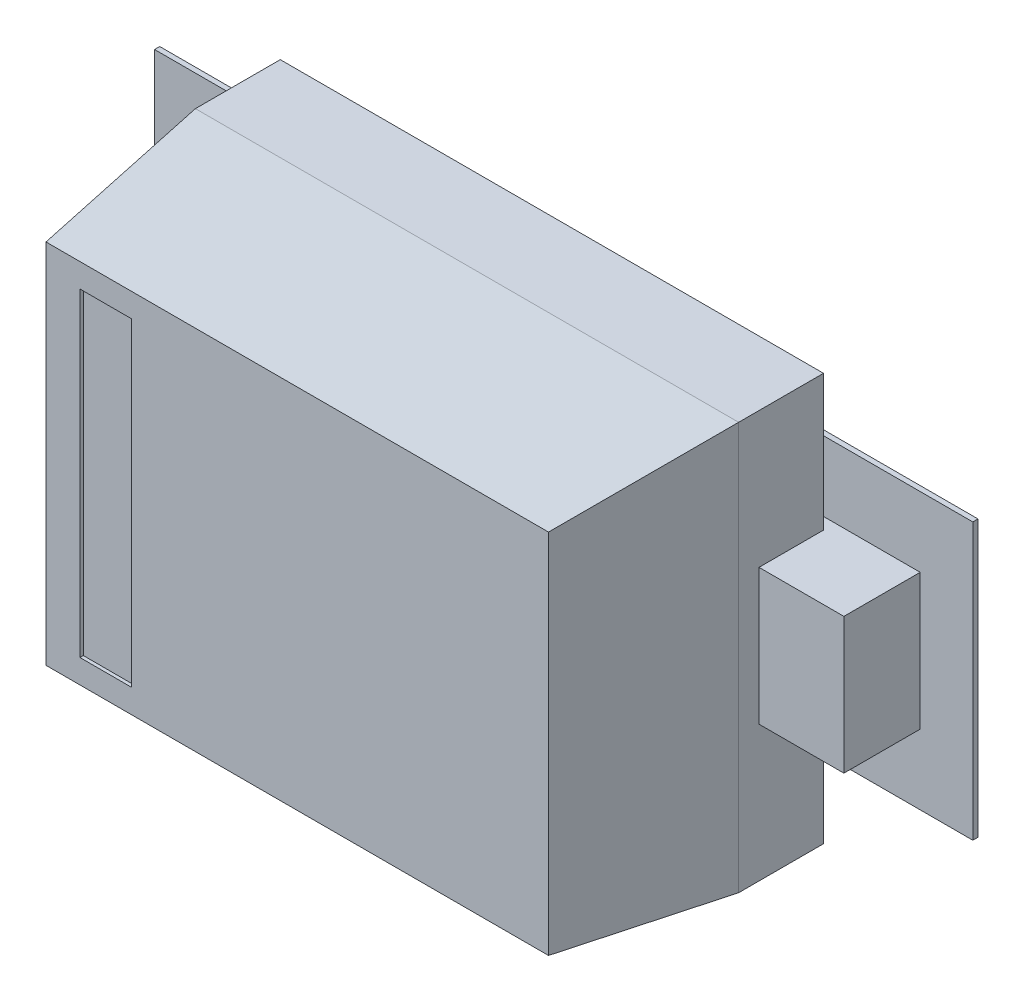
ISO-10303-21;
HEADER;
FILE_DESCRIPTION(('STEP AP214'),'2;1');
FILE_NAME('part.step','',(''),(''),'','','');
FILE_SCHEMA(('AUTOMOTIVE_DESIGN { 1 0 10303 214 1 1 1 1 }'));
ENDSEC;
DATA;
#1=APPLICATION_CONTEXT('core data for automotive mechanical design processes');
#2=APPLICATION_PROTOCOL_DEFINITION('international standard','automotive_design',2000,#1);
#3=PRODUCT_CONTEXT('',#1,'mechanical');
#4=PRODUCT('Part','Part','',(#3));
#5=PRODUCT_RELATED_PRODUCT_CATEGORY('part','',(#4));
#6=PRODUCT_DEFINITION_FORMATION('','',#4);
#7=PRODUCT_DEFINITION_CONTEXT('part definition',#1,'design');
#8=PRODUCT_DEFINITION('design','',#6,#7);
#9=PRODUCT_DEFINITION_SHAPE('','',#8);
#10=(LENGTH_UNIT() NAMED_UNIT(*) SI_UNIT(.MILLI.,.METRE.));
#11=(NAMED_UNIT(*) PLANE_ANGLE_UNIT() SI_UNIT($,.RADIAN.));
#12=(NAMED_UNIT(*) SI_UNIT($,.STERADIAN.) SOLID_ANGLE_UNIT());
#13=UNCERTAINTY_MEASURE_WITH_UNIT(LENGTH_MEASURE(1.E-05),#10,'distance_accuracy_value','');
#14=(GEOMETRIC_REPRESENTATION_CONTEXT(3) GLOBAL_UNCERTAINTY_ASSIGNED_CONTEXT((#13)) GLOBAL_UNIT_ASSIGNED_CONTEXT((#10,
#11,#12)) REPRESENTATION_CONTEXT('',''));
#15=CARTESIAN_POINT('',(0.,0.,0.));
#16=DIRECTION('',(0.,0.,1.));
#17=DIRECTION('',(1.,0.,0.));
#18=AXIS2_PLACEMENT_3D('',#15,#16,#17);
#19=CARTESIAN_POINT('',(-0.525,-0.1,0.0762));
#20=DIRECTION('',(-1.,0.,0.));
#21=DIRECTION('',(0.,0.,1.));
#22=AXIS2_PLACEMENT_3D('',#19,#20,#21);
#23=PLANE('',#22);
#24=DIRECTION('',(0.,1.,0.));
#25=VECTOR('',#24,1.);
#26=CARTESIAN_POINT('',(-0.525,-0.1,0.08382));
#27=LINE('',#26,#25);
#28=CARTESIAN_POINT('',(-0.525,-0.1,0.08382));
#29=VERTEX_POINT('',#28);
#30=CARTESIAN_POINT('',(-0.525,0.1,0.08382));
#31=VERTEX_POINT('',#30);
#32=EDGE_CURVE('E427',#29,#31,#27,.T.);
#33=ORIENTED_EDGE('',*,*,#32,.F.);
#34=DIRECTION('',(0.,0.,1.));
#35=VECTOR('',#34,1.);
#36=CARTESIAN_POINT('',(-0.525,-0.1,0.08382));
#37=LINE('',#36,#35);
#38=CARTESIAN_POINT('',(-0.525,-0.1,0.1962));
#39=VERTEX_POINT('',#38);
#40=EDGE_CURVE('E239',#29,#39,#37,.T.);
#41=ORIENTED_EDGE('',*,*,#40,.T.);
#42=DIRECTION('',(0.,1.,0.));
#43=VECTOR('',#42,1.);
#44=CARTESIAN_POINT('',(-0.525,-0.1,0.1962));
#45=LINE('',#44,#43);
#46=CARTESIAN_POINT('',(-0.525,0.1,0.1962));
#47=VERTEX_POINT('',#46);
#48=EDGE_CURVE('E11',#39,#47,#45,.T.);
#49=ORIENTED_EDGE('',*,*,#48,.T.);
#50=DIRECTION('',(0.,0.,1.));
#51=VECTOR('',#50,1.);
#52=CARTESIAN_POINT('',(-0.525,0.1,0.08382));
#53=LINE('',#52,#51);
#54=EDGE_CURVE('E20',#31,#47,#53,.T.);
#55=ORIENTED_EDGE('',*,*,#54,.F.);
#56=EDGE_LOOP('',(#33,#41,#49,#55));
#57=FACE_BOUND('',#56,.T.);
#58=ADVANCED_FACE('F16',(#57),#23,.T.);
#59=CARTESIAN_POINT('',(-0.525,-0.1,0.1962));
#60=DIRECTION('',(0.,0.,1.));
#61=DIRECTION('',(1.,0.,0.));
#62=AXIS2_PLACEMENT_3D('',#59,#60,#61);
#63=PLANE('',#62);
#64=DIRECTION('',(1.,0.,0.));
#65=VECTOR('',#64,1.);
#66=CARTESIAN_POINT('',(-0.525,-0.1,0.1962));
#67=LINE('',#66,#65);
#68=CARTESIAN_POINT('',(-0.4,-0.1,0.1962));
#69=VERTEX_POINT('',#68);
#70=EDGE_CURVE('E230',#39,#69,#67,.T.);
#71=ORIENTED_EDGE('',*,*,#70,.T.);
#72=DIRECTION('',(0.,1.,0.));
#73=VECTOR('',#72,1.);
#74=CARTESIAN_POINT('',(-0.4,-0.1,0.1962));
#75=LINE('',#74,#73);
#76=CARTESIAN_POINT('',(-0.4,0.1,0.1962));
#77=VERTEX_POINT('',#76);
#78=EDGE_CURVE('E234',#69,#77,#75,.T.);
#79=ORIENTED_EDGE('',*,*,#78,.T.);
#80=DIRECTION('',(1.,0.,0.));
#81=VECTOR('',#80,1.);
#82=CARTESIAN_POINT('',(-0.525,0.1,0.1962));
#83=LINE('',#82,#81);
#84=EDGE_CURVE('E539',#47,#77,#83,.T.);
#85=ORIENTED_EDGE('',*,*,#84,.F.);
#86=ORIENTED_EDGE('',*,*,#48,.F.);
#87=EDGE_LOOP('',(#71,#79,#85,#86));
#88=FACE_BOUND('',#87,.T.);
#89=ADVANCED_FACE('F232',(#88),#63,.T.);
#90=CARTESIAN_POINT('',(-0.325,-0.1,0.1962));
#91=DIRECTION('',(1.,0.,0.));
#92=DIRECTION('',(0.,1.,0.));
#93=AXIS2_PLACEMENT_3D('',#90,#91,#92);
#94=PLANE('',#93);
#95=DIRECTION('',(0.,1.,0.));
#96=VECTOR('',#95,1.);
#97=CARTESIAN_POINT('',(-0.325,-0.1,0.08382));
#98=LINE('',#97,#96);
#99=CARTESIAN_POINT('',(-0.325,-0.1,0.08382));
#100=VERTEX_POINT('',#99);
#101=CARTESIAN_POINT('',(-0.325,0.1,0.08382));
#102=VERTEX_POINT('',#101);
#103=EDGE_CURVE('E440',#100,#102,#98,.T.);
#104=ORIENTED_EDGE('',*,*,#103,.T.);
#105=DIRECTION('',(0.,0.,-1.));
#106=VECTOR('',#105,1.);
#107=CARTESIAN_POINT('',(-0.325,0.1,0.1012));
#108=LINE('',#107,#106);
#109=CARTESIAN_POINT('',(-0.325,0.1,0.1012));
#110=VERTEX_POINT('',#109);
#111=EDGE_CURVE('E27',#110,#102,#108,.T.);
#112=ORIENTED_EDGE('',*,*,#111,.F.);
#113=DIRECTION('',(0.,1.,0.));
#114=VECTOR('',#113,1.);
#115=CARTESIAN_POINT('',(-0.325,-0.1,0.1012));
#116=LINE('',#115,#114);
#117=CARTESIAN_POINT('',(-0.325,-0.1,0.1012));
#118=VERTEX_POINT('',#117);
#119=EDGE_CURVE('E465',#118,#110,#116,.T.);
#120=ORIENTED_EDGE('',*,*,#119,.F.);
#121=DIRECTION('',(0.,0.,-1.));
#122=VECTOR('',#121,1.);
#123=CARTESIAN_POINT('',(-0.325,-0.1,0.1012));
#124=LINE('',#123,#122);
#125=EDGE_CURVE('E240',#118,#100,#124,.T.);
#126=ORIENTED_EDGE('',*,*,#125,.T.);
#127=EDGE_LOOP('',(#104,#112,#120,#126));
#128=FACE_BOUND('',#127,.T.);
#129=ADVANCED_FACE('F656',(#128),#94,.T.);
#130=CARTESIAN_POINT('',(0.325,-0.1,0.0762));
#131=DIRECTION('',(-1.,0.,0.));
#132=DIRECTION('',(0.,0.,1.));
#133=AXIS2_PLACEMENT_3D('',#130,#131,#132);
#134=PLANE('',#133);
#135=DIRECTION('',(0.,1.,0.));
#136=VECTOR('',#135,1.);
#137=CARTESIAN_POINT('',(0.325,-0.1,0.08382));
#138=LINE('',#137,#136);
#139=CARTESIAN_POINT('',(0.325,-0.1,0.08382));
#140=VERTEX_POINT('',#139);
#141=CARTESIAN_POINT('',(0.325,0.1,0.08382));
#142=VERTEX_POINT('',#141);
#143=EDGE_CURVE('E321',#140,#142,#138,.T.);
#144=ORIENTED_EDGE('',*,*,#143,.F.);
#145=DIRECTION('',(0.,0.,1.));
#146=VECTOR('',#145,1.);
#147=CARTESIAN_POINT('',(0.325,-0.1,0.08382));
#148=LINE('',#147,#146);
#149=CARTESIAN_POINT('',(0.325,-0.1,0.1012));
#150=VERTEX_POINT('',#149);
#151=EDGE_CURVE('E274',#140,#150,#148,.T.);
#152=ORIENTED_EDGE('',*,*,#151,.T.);
#153=DIRECTION('',(0.,1.,0.));
#154=VECTOR('',#153,1.);
#155=CARTESIAN_POINT('',(0.325,-0.1,0.1012));
#156=LINE('',#155,#154);
#157=CARTESIAN_POINT('',(0.325,0.1,0.1012));
#158=VERTEX_POINT('',#157);
#159=EDGE_CURVE('E384',#150,#158,#156,.T.);
#160=ORIENTED_EDGE('',*,*,#159,.T.);
#161=DIRECTION('',(0.,0.,1.));
#162=VECTOR('',#161,1.);
#163=CARTESIAN_POINT('',(0.325,0.1,0.08382));
#164=LINE('',#163,#162);
#165=EDGE_CURVE('E444',#142,#158,#164,.T.);
#166=ORIENTED_EDGE('',*,*,#165,.F.);
#167=EDGE_LOOP('',(#144,#152,#160,#166));
#168=FACE_BOUND('',#167,.T.);
#169=ADVANCED_FACE('F875',(#168),#134,.T.);
#170=CARTESIAN_POINT('',(0.,0.1,0.));
#171=DIRECTION('',(0.,1.,0.));
#172=DIRECTION('',(1.,0.,0.));
#173=AXIS2_PLACEMENT_3D('',#170,#171,#172);
#174=PLANE('',#173);
#175=DIRECTION('',(-1.,0.,0.));
#176=VECTOR('',#175,1.);
#177=CARTESIAN_POINT('',(-0.325,0.1,0.08382));
#178=LINE('',#177,#176);
#179=EDGE_CURVE('E436',#102,#31,#178,.T.);
#180=ORIENTED_EDGE('',*,*,#179,.T.);
#181=ORIENTED_EDGE('',*,*,#54,.T.);
#182=ORIENTED_EDGE('',*,*,#84,.T.);
#183=DIRECTION('',(0.,0.,1.));
#184=VECTOR('',#183,1.);
#185=CARTESIAN_POINT('',(-0.4,0.1,0.1012));
#186=LINE('',#185,#184);
#187=CARTESIAN_POINT('',(-0.4,0.1,0.1012));
#188=VERTEX_POINT('',#187);
#189=EDGE_CURVE('E258',#188,#77,#186,.T.);
#190=ORIENTED_EDGE('',*,*,#189,.F.);
#191=DIRECTION('',(1.,0.,0.));
#192=VECTOR('',#191,1.);
#193=CARTESIAN_POINT('',(-0.4,0.1,0.1012));
#194=LINE('',#193,#192);
#195=EDGE_CURVE('E459',#188,#110,#194,.T.);
#196=ORIENTED_EDGE('',*,*,#195,.T.);
#197=ORIENTED_EDGE('',*,*,#111,.T.);
#198=EDGE_LOOP('',(#180,#181,#182,#190,#196,#197));
#199=FACE_BOUND('',#198,.T.);
#200=ADVANCED_FACE('F677',(#199),#174,.T.);
#201=CARTESIAN_POINT('',(0.,0.1,0.));
#202=DIRECTION('',(0.,1.,0.));
#203=DIRECTION('',(1.,0.,0.));
#204=AXIS2_PLACEMENT_3D('',#201,#202,#203);
#205=PLANE('',#204);
#206=DIRECTION('',(-1.,0.,0.));
#207=VECTOR('',#206,1.);
#208=CARTESIAN_POINT('',(0.525,0.1,0.08382));
#209=LINE('',#208,#207);
#210=CARTESIAN_POINT('',(0.525,0.1,0.08382));
#211=VERTEX_POINT('',#210);
#212=EDGE_CURVE('E325',#211,#142,#209,.T.);
#213=ORIENTED_EDGE('',*,*,#212,.T.);
#214=ORIENTED_EDGE('',*,*,#165,.T.);
#215=DIRECTION('',(1.,0.,0.));
#216=VECTOR('',#215,1.);
#217=CARTESIAN_POINT('',(0.325,0.1,0.1012));
#218=LINE('',#217,#216);
#219=CARTESIAN_POINT('',(0.4,0.1,0.1012));
#220=VERTEX_POINT('',#219);
#221=EDGE_CURVE('E388',#158,#220,#218,.T.);
#222=ORIENTED_EDGE('',*,*,#221,.T.);
#223=DIRECTION('',(0.,0.,-1.));
#224=VECTOR('',#223,1.);
#225=CARTESIAN_POINT('',(0.4,0.1,0.1962));
#226=LINE('',#225,#224);
#227=CARTESIAN_POINT('',(0.4,0.1,0.1962));
#228=VERTEX_POINT('',#227);
#229=EDGE_CURVE('E337',#228,#220,#226,.T.);
#230=ORIENTED_EDGE('',*,*,#229,.F.);
#231=DIRECTION('',(1.,0.,0.));
#232=VECTOR('',#231,1.);
#233=CARTESIAN_POINT('',(0.4,0.1,0.1962));
#234=LINE('',#233,#232);
#235=CARTESIAN_POINT('',(0.525,0.1,0.1962));
#236=VERTEX_POINT('',#235);
#237=EDGE_CURVE('E331',#228,#236,#234,.T.);
#238=ORIENTED_EDGE('',*,*,#237,.T.);
#239=DIRECTION('',(0.,0.,-1.));
#240=VECTOR('',#239,1.);
#241=CARTESIAN_POINT('',(0.525,0.1,0.1962));
#242=LINE('',#241,#240);
#243=EDGE_CURVE('E332',#236,#211,#242,.T.);
#244=ORIENTED_EDGE('',*,*,#243,.T.);
#245=EDGE_LOOP('',(#213,#214,#222,#230,#238,#244));
#246=FACE_BOUND('',#245,.T.);
#247=ADVANCED_FACE('F18',(#246),#205,.T.);
#248=CARTESIAN_POINT('',(0.,0.3,0.));
#249=DIRECTION('',(0.,1.,0.));
#250=DIRECTION('',(1.,0.,0.));
#251=AXIS2_PLACEMENT_3D('',#248,#249,#250);
#252=PLANE('',#251);
#253=DIRECTION('',(1.,0.,0.));
#254=VECTOR('',#253,1.);
#255=CARTESIAN_POINT('',(-0.4,0.3,0.2262));
#256=LINE('',#255,#254);
#257=CARTESIAN_POINT('',(-0.4,0.3,0.2262));
#258=VERTEX_POINT('',#257);
#259=CARTESIAN_POINT('',(0.4,0.3,0.2262));
#260=VERTEX_POINT('',#259);
#261=EDGE_CURVE('E441',#258,#260,#256,.T.);
#262=ORIENTED_EDGE('',*,*,#261,.T.);
#263=DIRECTION('',(0.,0.,-1.));
#264=VECTOR('',#263,1.);
#265=CARTESIAN_POINT('',(0.4,0.3,0.2262));
#266=LINE('',#265,#264);
#267=CARTESIAN_POINT('',(0.4,0.3,0.1012));
#268=VERTEX_POINT('',#267);
#269=EDGE_CURVE('E333',#260,#268,#266,.T.);
#270=ORIENTED_EDGE('',*,*,#269,.T.);
#271=DIRECTION('',(-1.,0.,0.));
#272=VECTOR('',#271,1.);
#273=CARTESIAN_POINT('',(0.4,0.3,0.1012));
#274=LINE('',#273,#272);
#275=CARTESIAN_POINT('',(-0.4,0.3,0.1012));
#276=VERTEX_POINT('',#275);
#277=EDGE_CURVE('E455',#268,#276,#274,.T.);
#278=ORIENTED_EDGE('',*,*,#277,.T.);
#279=DIRECTION('',(0.,0.,1.));
#280=VECTOR('',#279,1.);
#281=CARTESIAN_POINT('',(-0.4,0.3,0.1012));
#282=LINE('',#281,#280);
#283=EDGE_CURVE('E380',#276,#258,#282,.T.);
#284=ORIENTED_EDGE('',*,*,#283,.T.);
#285=EDGE_LOOP('',(#262,#270,#278,#284));
#286=FACE_BOUND('',#285,.T.);
#287=ADVANCED_FACE('F673',(#286),#252,.T.);
#288=CARTESIAN_POINT('',(0.,0.285,0.3512));
#289=DIRECTION('',(0.,0.992876838486925,0.119145220618403));
#290=DIRECTION('',(1.,0.,0.));
#291=AXIS2_PLACEMENT_3D('',#288,#289,#290);
#292=PLANE('',#291);
#293=ORIENTED_EDGE('',*,*,#261,.F.);
#294=DIRECTION('',(-0.118308451008796,0.118308451008796,-0.985903758406366));
#295=VECTOR('',#294,1.);
#296=CARTESIAN_POINT('',(-0.37,0.27,0.4762));
#297=LINE('',#296,#295);
#298=CARTESIAN_POINT('',(-0.37,0.27,0.4762));
#299=VERTEX_POINT('',#298);
#300=EDGE_CURVE('E356',#299,#258,#297,.T.);
#301=ORIENTED_EDGE('',*,*,#300,.F.);
#302=DIRECTION('',(1.,0.,0.));
#303=VECTOR('',#302,1.);
#304=CARTESIAN_POINT('',(-0.37,0.27,0.4762));
#305=LINE('',#304,#303);
#306=CARTESIAN_POINT('',(0.37,0.27,0.4762));
#307=VERTEX_POINT('',#306);
#308=EDGE_CURVE('E286',#299,#307,#305,.T.);
#309=ORIENTED_EDGE('',*,*,#308,.T.);
#310=DIRECTION('',(0.118308451008796,0.118308451008796,-0.985903758406366));
#311=VECTOR('',#310,1.);
#312=CARTESIAN_POINT('',(0.37,0.27,0.4762));
#313=LINE('',#312,#311);
#314=EDGE_CURVE('E336',#307,#260,#313,.T.);
#315=ORIENTED_EDGE('',*,*,#314,.T.);
#316=EDGE_LOOP('',(#293,#301,#309,#315));
#317=FACE_BOUND('',#316,.T.);
#318=ADVANCED_FACE('F671',(#317),#292,.T.);
#319=CARTESIAN_POINT('',(0.385,0.,0.3512));
#320=DIRECTION('',(0.992876838486925,0.,0.119145220618403));
#321=DIRECTION('',(0.,-1.,0.));
#322=AXIS2_PLACEMENT_3D('',#319,#320,#321);
#323=PLANE('',#322);
#324=DIRECTION('',(0.,-1.,0.));
#325=VECTOR('',#324,1.);
#326=CARTESIAN_POINT('',(0.4,0.3,0.2262));
#327=LINE('',#326,#325);
#328=CARTESIAN_POINT('',(0.4,-0.3,0.2262));
#329=VERTEX_POINT('',#328);
#330=EDGE_CURVE('E402',#260,#329,#327,.T.);
#331=ORIENTED_EDGE('',*,*,#330,.F.);
#332=ORIENTED_EDGE('',*,*,#314,.F.);
#333=DIRECTION('',(0.,-1.,0.));
#334=VECTOR('',#333,1.);
#335=CARTESIAN_POINT('',(0.37,0.27,0.4762));
#336=LINE('',#335,#334);
#337=CARTESIAN_POINT('',(0.37,-0.27,0.4762));
#338=VERTEX_POINT('',#337);
#339=EDGE_CURVE('E351',#307,#338,#336,.T.);
#340=ORIENTED_EDGE('',*,*,#339,.T.);
#341=DIRECTION('',(0.118308451008796,-0.118308451008796,-0.985903758406366));
#342=VECTOR('',#341,1.);
#343=CARTESIAN_POINT('',(0.37,-0.27,0.4762));
#344=LINE('',#343,#342);
#345=EDGE_CURVE('E347',#338,#329,#344,.T.);
#346=ORIENTED_EDGE('',*,*,#345,.T.);
#347=EDGE_LOOP('',(#331,#332,#340,#346));
#348=FACE_BOUND('',#347,.T.);
#349=ADVANCED_FACE('F667',(#348),#323,.T.);
#350=CARTESIAN_POINT('',(0.4,-0.3,0.4762));
#351=DIRECTION('',(1.,0.,0.));
#352=DIRECTION('',(0.,1.,0.));
#353=AXIS2_PLACEMENT_3D('',#350,#351,#352);
#354=PLANE('',#353);
#355=ORIENTED_EDGE('',*,*,#330,.T.);
#356=DIRECTION('',(0.,0.,-1.));
#357=VECTOR('',#356,1.);
#358=CARTESIAN_POINT('',(0.4,-0.3,0.2262));
#359=LINE('',#358,#357);
#360=CARTESIAN_POINT('',(0.4,-0.3,0.1012));
#361=VERTEX_POINT('',#360);
#362=EDGE_CURVE('E432',#329,#361,#359,.T.);
#363=ORIENTED_EDGE('',*,*,#362,.T.);
#364=DIRECTION('',(0.,1.,0.));
#365=VECTOR('',#364,1.);
#366=CARTESIAN_POINT('',(0.4,-0.3,0.1012));
#367=LINE('',#366,#365);
#368=CARTESIAN_POINT('',(0.4,-0.1,0.1012));
#369=VERTEX_POINT('',#368);
#370=EDGE_CURVE('E281',#361,#369,#367,.T.);
#371=ORIENTED_EDGE('',*,*,#370,.T.);
#372=DIRECTION('',(0.,0.,-1.));
#373=VECTOR('',#372,1.);
#374=CARTESIAN_POINT('',(0.4,-0.1,0.1962));
#375=LINE('',#374,#373);
#376=CARTESIAN_POINT('',(0.4,-0.1,0.1962));
#377=VERTEX_POINT('',#376);
#378=EDGE_CURVE('E271',#377,#369,#375,.T.);
#379=ORIENTED_EDGE('',*,*,#378,.F.);
#380=DIRECTION('',(0.,1.,0.));
#381=VECTOR('',#380,1.);
#382=CARTESIAN_POINT('',(0.4,-0.1,0.1962));
#383=LINE('',#382,#381);
#384=EDGE_CURVE('E346',#377,#228,#383,.T.);
#385=ORIENTED_EDGE('',*,*,#384,.T.);
#386=ORIENTED_EDGE('',*,*,#229,.T.);
#387=DIRECTION('',(0.,1.,0.));
#388=VECTOR('',#387,1.);
#389=CARTESIAN_POINT('',(0.4,0.1,0.1012));
#390=LINE('',#389,#388);
#391=EDGE_CURVE('E458',#220,#268,#390,.T.);
#392=ORIENTED_EDGE('',*,*,#391,.T.);
#393=ORIENTED_EDGE('',*,*,#269,.F.);
#394=EDGE_LOOP('',(#355,#363,#371,#379,#385,#386,#392,#393));
#395=FACE_BOUND('',#394,.T.);
#396=ADVANCED_FACE('F663',(#395),#354,.T.);
#397=CARTESIAN_POINT('',(0.325,-0.1,0.1962));
#398=DIRECTION('',(0.,0.,1.));
#399=DIRECTION('',(1.,0.,0.));
#400=AXIS2_PLACEMENT_3D('',#397,#398,#399);
#401=PLANE('',#400);
#402=DIRECTION('',(1.,0.,0.));
#403=VECTOR('',#402,1.);
#404=CARTESIAN_POINT('',(0.4,-0.1,0.1962));
#405=LINE('',#404,#403);
#406=CARTESIAN_POINT('',(0.525,-0.1,0.1962));
#407=VERTEX_POINT('',#406);
#408=EDGE_CURVE('E275',#377,#407,#405,.T.);
#409=ORIENTED_EDGE('',*,*,#408,.T.);
#410=DIRECTION('',(0.,1.,0.));
#411=VECTOR('',#410,1.);
#412=CARTESIAN_POINT('',(0.525,-0.1,0.1962));
#413=LINE('',#412,#411);
#414=EDGE_CURVE('E327',#407,#236,#413,.T.);
#415=ORIENTED_EDGE('',*,*,#414,.T.);
#416=ORIENTED_EDGE('',*,*,#237,.F.);
#417=ORIENTED_EDGE('',*,*,#384,.F.);
#418=EDGE_LOOP('',(#409,#415,#416,#417));
#419=FACE_BOUND('',#418,.T.);
#420=ADVANCED_FACE('F891',(#419),#401,.T.);
#421=CARTESIAN_POINT('',(0.525,-0.1,0.1962));
#422=DIRECTION('',(1.,0.,0.));
#423=DIRECTION('',(0.,1.,0.));
#424=AXIS2_PLACEMENT_3D('',#421,#422,#423);
#425=PLANE('',#424);
#426=DIRECTION('',(0.,1.,0.));
#427=VECTOR('',#426,1.);
#428=CARTESIAN_POINT('',(0.525,-0.1,0.08382));
#429=LINE('',#428,#427);
#430=CARTESIAN_POINT('',(0.525,-0.1,0.08382));
#431=VERTEX_POINT('',#430);
#432=EDGE_CURVE('E370',#431,#211,#429,.T.);
#433=ORIENTED_EDGE('',*,*,#432,.T.);
#434=ORIENTED_EDGE('',*,*,#243,.F.);
#435=ORIENTED_EDGE('',*,*,#414,.F.);
#436=DIRECTION('',(0.,0.,-1.));
#437=VECTOR('',#436,1.);
#438=CARTESIAN_POINT('',(0.525,-0.1,0.1962));
#439=LINE('',#438,#437);
#440=EDGE_CURVE('E280',#407,#431,#439,.T.);
#441=ORIENTED_EDGE('',*,*,#440,.T.);
#442=EDGE_LOOP('',(#433,#434,#435,#441));
#443=FACE_BOUND('',#442,.T.);
#444=ADVANCED_FACE('F727',(#443),#425,.T.);
#445=CARTESIAN_POINT('',(-0.2975102,-0.2029968,0.0762));
#446=DIRECTION('',(1.,0.,0.));
#447=DIRECTION('',(0.,1.,0.));
#448=AXIS2_PLACEMENT_3D('',#445,#446,#447);
#449=PLANE('',#448);
#450=DIRECTION('',(0.,1.,0.));
#451=VECTOR('',#450,1.);
#452=CARTESIAN_POINT('',(-0.2975102,-0.2029968,0.0762));
#453=LINE('',#452,#451);
#454=CARTESIAN_POINT('',(-0.2975102,-0.2029968,0.0762));
#455=VERTEX_POINT('',#454);
#456=CARTESIAN_POINT('',(-0.2975102,0.2029968,0.0762));
#457=VERTEX_POINT('',#456);
#458=EDGE_CURVE('E452',#455,#457,#453,.T.);
#459=ORIENTED_EDGE('',*,*,#458,.T.);
#460=DIRECTION('',(0.,0.,1.));
#461=VECTOR('',#460,1.);
#462=CARTESIAN_POINT('',(-0.2975102,0.2029968,0.0762));
#463=LINE('',#462,#461);
#464=CARTESIAN_POINT('',(-0.2975102,0.2029968,0.08382));
#465=VERTEX_POINT('',#464);
#466=EDGE_CURVE('E397',#457,#465,#463,.T.);
#467=ORIENTED_EDGE('',*,*,#466,.T.);
#468=DIRECTION('',(0.,1.,0.));
#469=VECTOR('',#468,1.);
#470=CARTESIAN_POINT('',(-0.2975102,-0.2029968,0.08382));
#471=LINE('',#470,#469);
#472=CARTESIAN_POINT('',(-0.2975102,-0.2029968,0.08382));
#473=VERTEX_POINT('',#472);
#474=EDGE_CURVE('E375',#473,#465,#471,.T.);
#475=ORIENTED_EDGE('',*,*,#474,.F.);
#476=DIRECTION('',(0.,0.,1.));
#477=VECTOR('',#476,1.);
#478=CARTESIAN_POINT('',(-0.2975102,-0.2029968,0.0762));
#479=LINE('',#478,#477);
#480=EDGE_CURVE('E317',#455,#473,#479,.T.);
#481=ORIENTED_EDGE('',*,*,#480,.F.);
#482=EDGE_LOOP('',(#459,#467,#475,#481));
#483=FACE_BOUND('',#482,.T.);
#484=ADVANCED_FACE('F721',(#483),#449,.T.);
#485=CARTESIAN_POINT('',(-0.602488,-0.2029968,0.0762));
#486=DIRECTION('',(0.,-1.,0.));
#487=DIRECTION('',(0.,0.,-1.));
#488=AXIS2_PLACEMENT_3D('',#485,#486,#487);
#489=PLANE('',#488);
#490=DIRECTION('',(1.,0.,0.));
#491=VECTOR('',#490,1.);
#492=CARTESIAN_POINT('',(-0.602488,-0.2029968,0.0762));
#493=LINE('',#492,#491);
#494=CARTESIAN_POINT('',(-0.602488,-0.2029968,0.0762));
#495=VERTEX_POINT('',#494);
#496=EDGE_CURVE('E393',#495,#455,#493,.T.);
#497=ORIENTED_EDGE('',*,*,#496,.T.);
#498=ORIENTED_EDGE('',*,*,#480,.T.);
#499=DIRECTION('',(1.,0.,0.));
#500=VECTOR('',#499,1.);
#501=CARTESIAN_POINT('',(-0.602488,-0.2029968,0.08382));
#502=LINE('',#501,#500);
#503=CARTESIAN_POINT('',(-0.602488,-0.2029968,0.08382));
#504=VERTEX_POINT('',#503);
#505=EDGE_CURVE('E371',#504,#473,#502,.T.);
#506=ORIENTED_EDGE('',*,*,#505,.F.);
#507=DIRECTION('',(0.,0.,1.));
#508=VECTOR('',#507,1.);
#509=CARTESIAN_POINT('',(-0.602488,-0.2029968,0.0762));
#510=LINE('',#509,#508);
#511=EDGE_CURVE('E309',#495,#504,#510,.T.);
#512=ORIENTED_EDGE('',*,*,#511,.F.);
#513=EDGE_LOOP('',(#497,#498,#506,#512));
#514=FACE_BOUND('',#513,.T.);
#515=ADVANCED_FACE('F726',(#514),#489,.T.);
#516=CARTESIAN_POINT('',(-0.602488,0.2029968,0.0762));
#517=DIRECTION('',(-1.,0.,0.));
#518=DIRECTION('',(0.,0.,1.));
#519=AXIS2_PLACEMENT_3D('',#516,#517,#518);
#520=PLANE('',#519);
#521=DIRECTION('',(0.,-1.,0.));
#522=VECTOR('',#521,1.);
#523=CARTESIAN_POINT('',(-0.602488,0.2029968,0.0762));
#524=LINE('',#523,#522);
#525=CARTESIAN_POINT('',(-0.602488,0.2029968,0.0762));
#526=VERTEX_POINT('',#525);
#527=EDGE_CURVE('E389',#526,#495,#524,.T.);
#528=ORIENTED_EDGE('',*,*,#527,.T.);
#529=ORIENTED_EDGE('',*,*,#511,.T.);
#530=DIRECTION('',(0.,-1.,0.));
#531=VECTOR('',#530,1.);
#532=CARTESIAN_POINT('',(-0.602488,0.2029968,0.08382));
#533=LINE('',#532,#531);
#534=CARTESIAN_POINT('',(-0.602488,0.2029968,0.08382));
#535=VERTEX_POINT('',#534);
#536=EDGE_CURVE('E376',#535,#504,#533,.T.);
#537=ORIENTED_EDGE('',*,*,#536,.F.);
#538=DIRECTION('',(0.,0.,1.));
#539=VECTOR('',#538,1.);
#540=CARTESIAN_POINT('',(-0.602488,0.2029968,0.0762));
#541=LINE('',#540,#539);
#542=EDGE_CURVE('E394',#526,#535,#541,.T.);
#543=ORIENTED_EDGE('',*,*,#542,.F.);
#544=EDGE_LOOP('',(#528,#529,#537,#543));
#545=FACE_BOUND('',#544,.T.);
#546=ADVANCED_FACE('F800',(#545),#520,.T.);
#547=CARTESIAN_POINT('',(0.2975102,0.2029968,0.0762));
#548=DIRECTION('',(-1.,0.,0.));
#549=DIRECTION('',(0.,0.,1.));
#550=AXIS2_PLACEMENT_3D('',#547,#548,#549);
#551=PLANE('',#550);
#552=DIRECTION('',(0.,-1.,0.));
#553=VECTOR('',#552,1.);
#554=CARTESIAN_POINT('',(0.2975102,0.2029968,0.0762));
#555=LINE('',#554,#553);
#556=CARTESIAN_POINT('',(0.2975102,0.2029968,0.0762));
#557=VERTEX_POINT('',#556);
#558=CARTESIAN_POINT('',(0.2975102,-0.2029968,0.0762));
#559=VERTEX_POINT('',#558);
#560=EDGE_CURVE('E305',#557,#559,#555,.T.);
#561=ORIENTED_EDGE('',*,*,#560,.T.);
#562=DIRECTION('',(0.,0.,1.));
#563=VECTOR('',#562,1.);
#564=CARTESIAN_POINT('',(0.2975102,-0.2029968,0.0762));
#565=LINE('',#564,#563);
#566=CARTESIAN_POINT('',(0.2975102,-0.2029968,0.08382));
#567=VERTEX_POINT('',#566);
#568=EDGE_CURVE('E58',#559,#567,#565,.T.);
#569=ORIENTED_EDGE('',*,*,#568,.T.);
#570=DIRECTION('',(0.,-1.,0.));
#571=VECTOR('',#570,1.);
#572=CARTESIAN_POINT('',(0.2975102,0.2029968,0.08382));
#573=LINE('',#572,#571);
#574=CARTESIAN_POINT('',(0.2975102,0.2029968,0.08382));
#575=VERTEX_POINT('',#574);
#576=EDGE_CURVE('E341',#575,#567,#573,.T.);
#577=ORIENTED_EDGE('',*,*,#576,.F.);
#578=DIRECTION('',(0.,0.,1.));
#579=VECTOR('',#578,1.);
#580=CARTESIAN_POINT('',(0.2975102,0.2029968,0.0762));
#581=LINE('',#580,#579);
#582=EDGE_CURVE('E75',#557,#575,#581,.T.);
#583=ORIENTED_EDGE('',*,*,#582,.F.);
#584=EDGE_LOOP('',(#561,#569,#577,#583));
#585=FACE_BOUND('',#584,.T.);
#586=ADVANCED_FACE('F790',(#585),#551,.T.);
#587=CARTESIAN_POINT('',(0.2975102,-0.2029968,0.0762));
#588=DIRECTION('',(0.,-1.,0.));
#589=DIRECTION('',(0.,0.,-1.));
#590=AXIS2_PLACEMENT_3D('',#587,#588,#589);
#591=PLANE('',#590);
#592=DIRECTION('',(1.,0.,0.));
#593=VECTOR('',#592,1.);
#594=CARTESIAN_POINT('',(0.2975102,-0.2029968,0.0762));
#595=LINE('',#594,#593);
#596=CARTESIAN_POINT('',(0.602488,-0.2029968,0.0762));
#597=VERTEX_POINT('',#596);
#598=EDGE_CURVE('E301',#559,#597,#595,.T.);
#599=ORIENTED_EDGE('',*,*,#598,.T.);
#600=DIRECTION('',(0.,0.,1.));
#601=VECTOR('',#600,1.);
#602=CARTESIAN_POINT('',(0.602488,-0.2029968,0.0762));
#603=LINE('',#602,#601);
#604=CARTESIAN_POINT('',(0.602488,-0.2029968,0.08382));
#605=VERTEX_POINT('',#604);
#606=EDGE_CURVE('E310',#597,#605,#603,.T.);
#607=ORIENTED_EDGE('',*,*,#606,.T.);
#608=DIRECTION('',(1.,0.,0.));
#609=VECTOR('',#608,1.);
#610=CARTESIAN_POINT('',(0.2975102,-0.2029968,0.08382));
#611=LINE('',#610,#609);
#612=EDGE_CURVE('E338',#567,#605,#611,.T.);
#613=ORIENTED_EDGE('',*,*,#612,.F.);
#614=ORIENTED_EDGE('',*,*,#568,.F.);
#615=EDGE_LOOP('',(#599,#607,#613,#614));
#616=FACE_BOUND('',#615,.T.);
#617=ADVANCED_FACE('F751',(#616),#591,.T.);
#618=CARTESIAN_POINT('',(0.602488,-0.2029968,0.0762));
#619=DIRECTION('',(1.,0.,0.));
#620=DIRECTION('',(0.,1.,0.));
#621=AXIS2_PLACEMENT_3D('',#618,#619,#620);
#622=PLANE('',#621);
#623=DIRECTION('',(0.,1.,0.));
#624=VECTOR('',#623,1.);
#625=CARTESIAN_POINT('',(0.602488,-0.2029968,0.0762));
#626=LINE('',#625,#624);
#627=CARTESIAN_POINT('',(0.602488,0.2029968,0.0762));
#628=VERTEX_POINT('',#627);
#629=EDGE_CURVE('E306',#597,#628,#626,.T.);
#630=ORIENTED_EDGE('',*,*,#629,.T.);
#631=DIRECTION('',(0.,0.,1.));
#632=VECTOR('',#631,1.);
#633=CARTESIAN_POINT('',(0.602488,0.2029968,0.0762));
#634=LINE('',#633,#632);
#635=CARTESIAN_POINT('',(0.602488,0.2029968,0.08382));
#636=VERTEX_POINT('',#635);
#637=EDGE_CURVE('E379',#628,#636,#634,.T.);
#638=ORIENTED_EDGE('',*,*,#637,.T.);
#639=DIRECTION('',(0.,1.,0.));
#640=VECTOR('',#639,1.);
#641=CARTESIAN_POINT('',(0.602488,-0.2029968,0.08382));
#642=LINE('',#641,#640);
#643=EDGE_CURVE('E326',#605,#636,#642,.T.);
#644=ORIENTED_EDGE('',*,*,#643,.F.);
#645=ORIENTED_EDGE('',*,*,#606,.F.);
#646=EDGE_LOOP('',(#630,#638,#644,#645));
#647=FACE_BOUND('',#646,.T.);
#648=ADVANCED_FACE('F745',(#647),#622,.T.);
#649=CARTESIAN_POINT('',(0.602488,0.2029968,0.0762));
#650=DIRECTION('',(0.,1.,0.));
#651=DIRECTION('',(1.,0.,0.));
#652=AXIS2_PLACEMENT_3D('',#649,#650,#651);
#653=PLANE('',#652);
#654=DIRECTION('',(-1.,0.,0.));
#655=VECTOR('',#654,1.);
#656=CARTESIAN_POINT('',(0.602488,0.2029968,0.0762));
#657=LINE('',#656,#655);
#658=EDGE_CURVE('E405',#628,#557,#657,.T.);
#659=ORIENTED_EDGE('',*,*,#658,.T.);
#660=ORIENTED_EDGE('',*,*,#582,.T.);
#661=DIRECTION('',(-1.,0.,0.));
#662=VECTOR('',#661,1.);
#663=CARTESIAN_POINT('',(0.602488,0.2029968,0.08382));
#664=LINE('',#663,#662);
#665=EDGE_CURVE('E475',#636,#575,#664,.T.);
#666=ORIENTED_EDGE('',*,*,#665,.F.);
#667=ORIENTED_EDGE('',*,*,#637,.F.);
#668=EDGE_LOOP('',(#659,#660,#666,#667));
#669=FACE_BOUND('',#668,.T.);
#670=ADVANCED_FACE('F750',(#669),#653,.T.);
#671=CARTESIAN_POINT('',(-0.325,-0.1,0.0762));
#672=DIRECTION('',(0.,0.,-1.));
#673=DIRECTION('',(0.,-1.,0.));
#674=AXIS2_PLACEMENT_3D('',#671,#672,#673);
#675=PLANE('',#674);
#676=DIRECTION('',(-1.,0.,0.));
#677=VECTOR('',#676,1.);
#678=CARTESIAN_POINT('',(-0.2975102,0.2029968,0.0762));
#679=LINE('',#678,#677);
#680=EDGE_CURVE('E398',#457,#526,#679,.T.);
#681=ORIENTED_EDGE('',*,*,#680,.F.);
#682=ORIENTED_EDGE('',*,*,#458,.F.);
#683=ORIENTED_EDGE('',*,*,#496,.F.);
#684=ORIENTED_EDGE('',*,*,#527,.F.);
#685=EDGE_LOOP('',(#681,#682,#683,#684));
#686=FACE_BOUND('',#685,.T.);
#687=ADVANCED_FACE('F700',(#686),#675,.T.);
#688=CARTESIAN_POINT('',(-0.325,-0.1,0.0762));
#689=DIRECTION('',(0.,0.,-1.));
#690=DIRECTION('',(0.,-1.,0.));
#691=AXIS2_PLACEMENT_3D('',#688,#689,#690);
#692=PLANE('',#691);
#693=ORIENTED_EDGE('',*,*,#658,.F.);
#694=ORIENTED_EDGE('',*,*,#629,.F.);
#695=ORIENTED_EDGE('',*,*,#598,.F.);
#696=ORIENTED_EDGE('',*,*,#560,.F.);
#697=EDGE_LOOP('',(#693,#694,#695,#696));
#698=FACE_BOUND('',#697,.T.);
#699=ADVANCED_FACE('F694',(#698),#692,.T.);
#700=CARTESIAN_POINT('',(-0.2975102,0.2029968,0.0762));
#701=DIRECTION('',(0.,1.,0.));
#702=DIRECTION('',(1.,0.,0.));
#703=AXIS2_PLACEMENT_3D('',#700,#701,#702);
#704=PLANE('',#703);
#705=ORIENTED_EDGE('',*,*,#680,.T.);
#706=ORIENTED_EDGE('',*,*,#542,.T.);
#707=DIRECTION('',(-1.,0.,0.));
#708=VECTOR('',#707,1.);
#709=CARTESIAN_POINT('',(-0.2975102,0.2029968,0.08382));
#710=LINE('',#709,#708);
#711=EDGE_CURVE('E313',#465,#535,#710,.T.);
#712=ORIENTED_EDGE('',*,*,#711,.F.);
#713=ORIENTED_EDGE('',*,*,#466,.F.);
#714=EDGE_LOOP('',(#705,#706,#712,#713));
#715=FACE_BOUND('',#714,.T.);
#716=ADVANCED_FACE('F699',(#715),#704,.T.);
#717=CARTESIAN_POINT('',(0.,0.,0.08382));
#718=DIRECTION('',(0.,0.,1.));
#719=DIRECTION('',(1.,0.,0.));
#720=AXIS2_PLACEMENT_3D('',#717,#718,#719);
#721=PLANE('',#720);
#722=DIRECTION('',(-1.,0.,0.));
#723=VECTOR('',#722,1.);
#724=CARTESIAN_POINT('',(0.525,-0.1,0.08382));
#725=LINE('',#724,#723);
#726=EDGE_CURVE('E276',#431,#140,#725,.T.);
#727=ORIENTED_EDGE('',*,*,#726,.T.);
#728=ORIENTED_EDGE('',*,*,#143,.T.);
#729=ORIENTED_EDGE('',*,*,#212,.F.);
#730=ORIENTED_EDGE('',*,*,#432,.F.);
#731=EDGE_LOOP('',(#727,#728,#729,#730));
#732=FACE_BOUND('',#731,.T.);
#733=ORIENTED_EDGE('',*,*,#665,.T.);
#734=ORIENTED_EDGE('',*,*,#576,.T.);
#735=ORIENTED_EDGE('',*,*,#612,.T.);
#736=ORIENTED_EDGE('',*,*,#643,.T.);
#737=EDGE_LOOP('',(#733,#734,#735,#736));
#738=FACE_BOUND('',#737,.T.);
#739=ADVANCED_FACE('F713',(#732,#738),#721,.T.);
#740=CARTESIAN_POINT('',(0.,0.,0.08382));
#741=DIRECTION('',(0.,0.,1.));
#742=DIRECTION('',(1.,0.,0.));
#743=AXIS2_PLACEMENT_3D('',#740,#741,#742);
#744=PLANE('',#743);
#745=DIRECTION('',(-1.,0.,0.));
#746=VECTOR('',#745,1.);
#747=CARTESIAN_POINT('',(-0.325,-0.1,0.08382));
#748=LINE('',#747,#746);
#749=EDGE_CURVE('E297',#100,#29,#748,.T.);
#750=ORIENTED_EDGE('',*,*,#749,.T.);
#751=ORIENTED_EDGE('',*,*,#32,.T.);
#752=ORIENTED_EDGE('',*,*,#179,.F.);
#753=ORIENTED_EDGE('',*,*,#103,.F.);
#754=EDGE_LOOP('',(#750,#751,#752,#753));
#755=FACE_BOUND('',#754,.T.);
#756=ORIENTED_EDGE('',*,*,#711,.T.);
#757=ORIENTED_EDGE('',*,*,#536,.T.);
#758=ORIENTED_EDGE('',*,*,#505,.T.);
#759=ORIENTED_EDGE('',*,*,#474,.T.);
#760=EDGE_LOOP('',(#756,#757,#758,#759));
#761=FACE_BOUND('',#760,.T.);
#762=ADVANCED_FACE('F708',(#755,#761),#744,.T.);
#763=CARTESIAN_POINT('',(0.,-0.1,0.));
#764=DIRECTION('',(0.,1.,0.));
#765=DIRECTION('',(1.,0.,0.));
#766=AXIS2_PLACEMENT_3D('',#763,#764,#765);
#767=PLANE('',#766);
#768=ORIENTED_EDGE('',*,*,#749,.F.);
#769=ORIENTED_EDGE('',*,*,#125,.F.);
#770=DIRECTION('',(1.,0.,0.));
#771=VECTOR('',#770,1.);
#772=CARTESIAN_POINT('',(-0.4,-0.1,0.1012));
#773=LINE('',#772,#771);
#774=CARTESIAN_POINT('',(-0.4,-0.1,0.1012));
#775=VERTEX_POINT('',#774);
#776=EDGE_CURVE('E248',#775,#118,#773,.T.);
#777=ORIENTED_EDGE('',*,*,#776,.F.);
#778=DIRECTION('',(0.,0.,1.));
#779=VECTOR('',#778,1.);
#780=CARTESIAN_POINT('',(-0.4,-0.1,0.1012));
#781=LINE('',#780,#779);
#782=EDGE_CURVE('E243',#775,#69,#781,.T.);
#783=ORIENTED_EDGE('',*,*,#782,.T.);
#784=ORIENTED_EDGE('',*,*,#70,.F.);
#785=ORIENTED_EDGE('',*,*,#40,.F.);
#786=EDGE_LOOP('',(#768,#769,#777,#783,#784,#785));
#787=FACE_BOUND('',#786,.T.);
#788=ADVANCED_FACE('F245',(#787),#767,.F.);
#789=CARTESIAN_POINT('',(0.,-0.1,0.));
#790=DIRECTION('',(0.,1.,0.));
#791=DIRECTION('',(1.,0.,0.));
#792=AXIS2_PLACEMENT_3D('',#789,#790,#791);
#793=PLANE('',#792);
#794=ORIENTED_EDGE('',*,*,#726,.F.);
#795=ORIENTED_EDGE('',*,*,#440,.F.);
#796=ORIENTED_EDGE('',*,*,#408,.F.);
#797=ORIENTED_EDGE('',*,*,#378,.T.);
#798=DIRECTION('',(1.,0.,0.));
#799=VECTOR('',#798,1.);
#800=CARTESIAN_POINT('',(0.325,-0.1,0.1012));
#801=LINE('',#800,#799);
#802=EDGE_CURVE('E290',#150,#369,#801,.T.);
#803=ORIENTED_EDGE('',*,*,#802,.F.);
#804=ORIENTED_EDGE('',*,*,#151,.F.);
#805=EDGE_LOOP('',(#794,#795,#796,#797,#803,#804));
#806=FACE_BOUND('',#805,.T.);
#807=ADVANCED_FACE('F901',(#806),#793,.F.);
#808=CARTESIAN_POINT('',(-0.41,-0.3302,0.1012));
#809=DIRECTION('',(0.,0.,1.));
#810=DIRECTION('',(1.,0.,0.));
#811=AXIS2_PLACEMENT_3D('',#808,#809,#810);
#812=PLANE('',#811);
#813=ORIENTED_EDGE('',*,*,#776,.T.);
#814=ORIENTED_EDGE('',*,*,#119,.T.);
#815=ORIENTED_EDGE('',*,*,#195,.F.);
#816=DIRECTION('',(0.,1.,0.));
#817=VECTOR('',#816,1.);
#818=CARTESIAN_POINT('',(-0.4,0.1,0.1012));
#819=LINE('',#818,#817);
#820=EDGE_CURVE('E265',#188,#276,#819,.T.);
#821=ORIENTED_EDGE('',*,*,#820,.T.);
#822=ORIENTED_EDGE('',*,*,#277,.F.);
#823=ORIENTED_EDGE('',*,*,#391,.F.);
#824=ORIENTED_EDGE('',*,*,#221,.F.);
#825=ORIENTED_EDGE('',*,*,#159,.F.);
#826=ORIENTED_EDGE('',*,*,#802,.T.);
#827=ORIENTED_EDGE('',*,*,#370,.F.);
#828=DIRECTION('',(-1.,0.,0.));
#829=VECTOR('',#828,1.);
#830=CARTESIAN_POINT('',(0.4,-0.3,0.1012));
#831=LINE('',#830,#829);
#832=CARTESIAN_POINT('',(-0.4,-0.3,0.1012));
#833=VERTEX_POINT('',#832);
#834=EDGE_CURVE('E451',#361,#833,#831,.T.);
#835=ORIENTED_EDGE('',*,*,#834,.T.);
#836=DIRECTION('',(0.,1.,0.));
#837=VECTOR('',#836,1.);
#838=CARTESIAN_POINT('',(-0.4,-0.3,0.1012));
#839=LINE('',#838,#837);
#840=EDGE_CURVE('E252',#833,#775,#839,.T.);
#841=ORIENTED_EDGE('',*,*,#840,.T.);
#842=EDGE_LOOP('',(#813,#814,#815,#821,#822,#823,#824,#825,#826,#827,#835,#841));
#843=FACE_BOUND('',#842,.T.);
#844=ADVANCED_FACE('F658',(#843),#812,.F.);
#845=CARTESIAN_POINT('',(-0.4,-0.3,0.0762));
#846=DIRECTION('',(-1.,0.,0.));
#847=DIRECTION('',(0.,0.,1.));
#848=AXIS2_PLACEMENT_3D('',#845,#846,#847);
#849=PLANE('',#848);
#850=DIRECTION('',(0.,0.,1.));
#851=VECTOR('',#850,1.);
#852=CARTESIAN_POINT('',(-0.4,-0.3,0.1012));
#853=LINE('',#852,#851);
#854=CARTESIAN_POINT('',(-0.4,-0.3,0.2262));
#855=VERTEX_POINT('',#854);
#856=EDGE_CURVE('E536',#833,#855,#853,.T.);
#857=ORIENTED_EDGE('',*,*,#856,.T.);
#858=DIRECTION('',(0.,-1.,0.));
#859=VECTOR('',#858,1.);
#860=CARTESIAN_POINT('',(-0.4,0.3,0.2262));
#861=LINE('',#860,#859);
#862=EDGE_CURVE('E360',#258,#855,#861,.T.);
#863=ORIENTED_EDGE('',*,*,#862,.F.);
#864=ORIENTED_EDGE('',*,*,#283,.F.);
#865=ORIENTED_EDGE('',*,*,#820,.F.);
#866=ORIENTED_EDGE('',*,*,#189,.T.);
#867=ORIENTED_EDGE('',*,*,#78,.F.);
#868=ORIENTED_EDGE('',*,*,#782,.F.);
#869=ORIENTED_EDGE('',*,*,#840,.F.);
#870=EDGE_LOOP('',(#857,#863,#864,#865,#866,#867,#868,#869));
#871=FACE_BOUND('',#870,.T.);
#872=ADVANCED_FACE('F255',(#871),#849,.T.);
#873=CARTESIAN_POINT('',(-0.385,0.,0.3512));
#874=DIRECTION('',(-0.992876838486925,0.,0.119145220618403));
#875=DIRECTION('',(0.,1.,0.));
#876=AXIS2_PLACEMENT_3D('',#873,#874,#875);
#877=PLANE('',#876);
#878=DIRECTION('',(0.118308451008796,0.118308451008796,0.985903758406366));
#879=VECTOR('',#878,1.);
#880=CARTESIAN_POINT('',(-0.4,-0.3,0.2262));
#881=LINE('',#880,#879);
#882=CARTESIAN_POINT('',(-0.37,-0.27,0.4762));
#883=VERTEX_POINT('',#882);
#884=EDGE_CURVE('E352',#855,#883,#881,.T.);
#885=ORIENTED_EDGE('',*,*,#884,.T.);
#886=DIRECTION('',(0.,-1.,0.));
#887=VECTOR('',#886,1.);
#888=CARTESIAN_POINT('',(-0.37,0.27,0.4762));
#889=LINE('',#888,#887);
#890=EDGE_CURVE('E282',#299,#883,#889,.T.);
#891=ORIENTED_EDGE('',*,*,#890,.F.);
#892=ORIENTED_EDGE('',*,*,#300,.T.);
#893=ORIENTED_EDGE('',*,*,#862,.T.);
#894=EDGE_LOOP('',(#885,#891,#892,#893));
#895=FACE_BOUND('',#894,.T.);
#896=ADVANCED_FACE('F566',(#895),#877,.T.);
#897=CARTESIAN_POINT('',(0.,-0.3,0.4712));
#898=DIRECTION('',(0.,0.,1.));
#899=DIRECTION('',(1.,0.,0.));
#900=AXIS2_PLACEMENT_3D('',#897,#898,#899);
#901=PLANE('',#900);
#902=DIRECTION('',(0.,1.,0.));
#903=VECTOR('',#902,1.);
#904=CARTESIAN_POINT('',(-0.2438,-0.235,0.4712));
#905=LINE('',#904,#903);
#906=CARTESIAN_POINT('',(-0.2438,-0.235,0.4712));
#907=VERTEX_POINT('',#906);
#908=CARTESIAN_POINT('',(-0.2438,0.235,0.4712));
#909=VERTEX_POINT('',#908);
#910=EDGE_CURVE('E420',#907,#909,#905,.T.);
#911=ORIENTED_EDGE('',*,*,#910,.T.);
#912=DIRECTION('',(-1.,0.,0.));
#913=VECTOR('',#912,1.);
#914=CARTESIAN_POINT('',(-0.2438,0.235,0.4712));
#915=LINE('',#914,#913);
#916=CARTESIAN_POINT('',(-0.32,0.235,0.4712));
#917=VERTEX_POINT('',#916);
#918=EDGE_CURVE('E361',#909,#917,#915,.T.);
#919=ORIENTED_EDGE('',*,*,#918,.T.);
#920=DIRECTION('',(0.,-1.,0.));
#921=VECTOR('',#920,1.);
#922=CARTESIAN_POINT('',(-0.32,0.235,0.4712));
#923=LINE('',#922,#921);
#924=CARTESIAN_POINT('',(-0.32,-0.235,0.4712));
#925=VERTEX_POINT('',#924);
#926=EDGE_CURVE('E366',#917,#925,#923,.T.);
#927=ORIENTED_EDGE('',*,*,#926,.T.);
#928=DIRECTION('',(1.,0.,0.));
#929=VECTOR('',#928,1.);
#930=CARTESIAN_POINT('',(-0.32,-0.235,0.4712));
#931=LINE('',#930,#929);
#932=EDGE_CURVE('E493',#925,#907,#931,.T.);
#933=ORIENTED_EDGE('',*,*,#932,.T.);
#934=EDGE_LOOP('',(#911,#919,#927,#933));
#935=FACE_BOUND('',#934,.T.);
#936=ADVANCED_FACE('F603',(#935),#901,.T.);
#937=CARTESIAN_POINT('',(-0.2438,0.235,0.4762));
#938=DIRECTION('',(0.,1.,0.));
#939=DIRECTION('',(1.,0.,0.));
#940=AXIS2_PLACEMENT_3D('',#937,#938,#939);
#941=PLANE('',#940);
#942=DIRECTION('',(-1.,0.,0.));
#943=VECTOR('',#942,1.);
#944=CARTESIAN_POINT('',(-0.2438,0.235,0.4762));
#945=LINE('',#944,#943);
#946=CARTESIAN_POINT('',(-0.2438,0.235,0.4762));
#947=VERTEX_POINT('',#946);
#948=CARTESIAN_POINT('',(-0.32,0.235,0.4762));
#949=VERTEX_POINT('',#948);
#950=EDGE_CURVE('E295',#947,#949,#945,.T.);
#951=ORIENTED_EDGE('',*,*,#950,.T.);
#952=DIRECTION('',(0.,0.,-1.));
#953=VECTOR('',#952,1.);
#954=CARTESIAN_POINT('',(-0.32,0.235,0.4762));
#955=LINE('',#954,#953);
#956=EDGE_CURVE('E362',#949,#917,#955,.T.);
#957=ORIENTED_EDGE('',*,*,#956,.T.);
#958=ORIENTED_EDGE('',*,*,#918,.F.);
#959=DIRECTION('',(0.,0.,-1.));
#960=VECTOR('',#959,1.);
#961=CARTESIAN_POINT('',(-0.2438,0.235,0.4762));
#962=LINE('',#961,#960);
#963=EDGE_CURVE('E416',#947,#909,#962,.T.);
#964=ORIENTED_EDGE('',*,*,#963,.F.);
#965=EDGE_LOOP('',(#951,#957,#958,#964));
#966=FACE_BOUND('',#965,.T.);
#967=ADVANCED_FACE('F616',(#966),#941,.F.);
#968=CARTESIAN_POINT('',(-0.32,0.235,0.4762));
#969=DIRECTION('',(-1.,0.,0.));
#970=DIRECTION('',(0.,0.,1.));
#971=AXIS2_PLACEMENT_3D('',#968,#969,#970);
#972=PLANE('',#971);
#973=DIRECTION('',(0.,-1.,0.));
#974=VECTOR('',#973,1.);
#975=CARTESIAN_POINT('',(-0.32,0.235,0.4762));
#976=LINE('',#975,#974);
#977=CARTESIAN_POINT('',(-0.32,-0.235,0.4762));
#978=VERTEX_POINT('',#977);
#979=EDGE_CURVE('E291',#949,#978,#976,.T.);
#980=ORIENTED_EDGE('',*,*,#979,.T.);
#981=DIRECTION('',(0.,0.,-1.));
#982=VECTOR('',#981,1.);
#983=CARTESIAN_POINT('',(-0.32,-0.235,0.4762));
#984=LINE('',#983,#982);
#985=EDGE_CURVE('E464',#978,#925,#984,.T.);
#986=ORIENTED_EDGE('',*,*,#985,.T.);
#987=ORIENTED_EDGE('',*,*,#926,.F.);
#988=ORIENTED_EDGE('',*,*,#956,.F.);
#989=EDGE_LOOP('',(#980,#986,#987,#988));
#990=FACE_BOUND('',#989,.T.);
#991=ADVANCED_FACE('F622',(#990),#972,.F.);
#992=CARTESIAN_POINT('',(-0.32,-0.235,0.4762));
#993=DIRECTION('',(0.,-1.,0.));
#994=DIRECTION('',(0.,0.,-1.));
#995=AXIS2_PLACEMENT_3D('',#992,#993,#994);
#996=PLANE('',#995);
#997=DIRECTION('',(1.,0.,0.));
#998=VECTOR('',#997,1.);
#999=CARTESIAN_POINT('',(-0.32,-0.235,0.4762));
#1000=LINE('',#999,#998);
#1001=CARTESIAN_POINT('',(-0.2438,-0.235,0.4762));
#1002=VERTEX_POINT('',#1001);
#1003=EDGE_CURVE('E296',#978,#1002,#1000,.T.);
#1004=ORIENTED_EDGE('',*,*,#1003,.T.);
#1005=DIRECTION('',(0.,0.,-1.));
#1006=VECTOR('',#1005,1.);
#1007=CARTESIAN_POINT('',(-0.2438,-0.235,0.4762));
#1008=LINE('',#1007,#1006);
#1009=EDGE_CURVE('E489',#1002,#907,#1008,.T.);
#1010=ORIENTED_EDGE('',*,*,#1009,.T.);
#1011=ORIENTED_EDGE('',*,*,#932,.F.);
#1012=ORIENTED_EDGE('',*,*,#985,.F.);
#1013=EDGE_LOOP('',(#1004,#1010,#1011,#1012));
#1014=FACE_BOUND('',#1013,.T.);
#1015=ADVANCED_FACE('F609',(#1014),#996,.F.);
#1016=CARTESIAN_POINT('',(-0.2438,-0.235,0.4762));
#1017=DIRECTION('',(1.,0.,0.));
#1018=DIRECTION('',(0.,1.,0.));
#1019=AXIS2_PLACEMENT_3D('',#1016,#1017,#1018);
#1020=PLANE('',#1019);
#1021=DIRECTION('',(0.,1.,0.));
#1022=VECTOR('',#1021,1.);
#1023=CARTESIAN_POINT('',(-0.2438,-0.235,0.4762));
#1024=LINE('',#1023,#1022);
#1025=EDGE_CURVE('E285',#1002,#947,#1024,.T.);
#1026=ORIENTED_EDGE('',*,*,#1025,.T.);
#1027=ORIENTED_EDGE('',*,*,#963,.T.);
#1028=ORIENTED_EDGE('',*,*,#910,.F.);
#1029=ORIENTED_EDGE('',*,*,#1009,.F.);
#1030=EDGE_LOOP('',(#1026,#1027,#1028,#1029));
#1031=FACE_BOUND('',#1030,.T.);
#1032=ADVANCED_FACE('F613',(#1031),#1020,.F.);
#1033=CARTESIAN_POINT('',(-0.4,-0.3,0.4762));
#1034=DIRECTION('',(0.,0.,1.));
#1035=DIRECTION('',(1.,0.,0.));
#1036=AXIS2_PLACEMENT_3D('',#1033,#1034,#1035);
#1037=PLANE('',#1036);
#1038=ORIENTED_EDGE('',*,*,#1025,.F.);
#1039=ORIENTED_EDGE('',*,*,#1003,.F.);
#1040=ORIENTED_EDGE('',*,*,#979,.F.);
#1041=ORIENTED_EDGE('',*,*,#950,.F.);
#1042=EDGE_LOOP('',(#1038,#1039,#1040,#1041));
#1043=FACE_BOUND('',#1042,.T.);
#1044=DIRECTION('',(-1.,0.,0.));
#1045=VECTOR('',#1044,1.);
#1046=CARTESIAN_POINT('',(0.37,-0.27,0.4762));
#1047=LINE('',#1046,#1045);
#1048=EDGE_CURVE('E428',#338,#883,#1047,.T.);
#1049=ORIENTED_EDGE('',*,*,#1048,.F.);
#1050=ORIENTED_EDGE('',*,*,#339,.F.);
#1051=ORIENTED_EDGE('',*,*,#308,.F.);
#1052=ORIENTED_EDGE('',*,*,#890,.T.);
#1053=EDGE_LOOP('',(#1049,#1050,#1051,#1052));
#1054=FACE_BOUND('',#1053,.T.);
#1055=ADVANCED_FACE('F619',(#1043,#1054),#1037,.T.);
#1056=CARTESIAN_POINT('',(0.,-0.285,0.3512));
#1057=DIRECTION('',(0.,-0.992876838486925,0.119145220618403));
#1058=DIRECTION('',(-1.,0.,0.));
#1059=AXIS2_PLACEMENT_3D('',#1056,#1057,#1058);
#1060=PLANE('',#1059);
#1061=ORIENTED_EDGE('',*,*,#1048,.T.);
#1062=ORIENTED_EDGE('',*,*,#884,.F.);
#1063=DIRECTION('',(-1.,0.,0.));
#1064=VECTOR('',#1063,1.);
#1065=CARTESIAN_POINT('',(0.4,-0.3,0.2262));
#1066=LINE('',#1065,#1064);
#1067=EDGE_CURVE('E269',#329,#855,#1066,.T.);
#1068=ORIENTED_EDGE('',*,*,#1067,.F.);
#1069=ORIENTED_EDGE('',*,*,#345,.F.);
#1070=EDGE_LOOP('',(#1061,#1062,#1068,#1069));
#1071=FACE_BOUND('',#1070,.T.);
#1072=ADVANCED_FACE('F571',(#1071),#1060,.T.);
#1073=CARTESIAN_POINT('',(0.,-0.3,0.));
#1074=DIRECTION('',(0.,1.,0.));
#1075=DIRECTION('',(1.,0.,0.));
#1076=AXIS2_PLACEMENT_3D('',#1073,#1074,#1075);
#1077=PLANE('',#1076);
#1078=ORIENTED_EDGE('',*,*,#1067,.T.);
#1079=ORIENTED_EDGE('',*,*,#856,.F.);
#1080=ORIENTED_EDGE('',*,*,#834,.F.);
#1081=ORIENTED_EDGE('',*,*,#362,.F.);
#1082=EDGE_LOOP('',(#1078,#1079,#1080,#1081));
#1083=FACE_BOUND('',#1082,.T.);
#1084=ADVANCED_FACE('F579',(#1083),#1077,.F.);
#1085=CLOSED_SHELL('',(#58,#89,#129,#169,#200,#247,#287,#318,#349,#396,#420,#444,#484,#515,#546,
#586,#617,#648,#670,#687,#699,#716,#739,#762,#788,#807,#844,#872,#896,#936,#967,#991,#1015,
#1032,#1055,#1072,#1084));
#1086=MANIFOLD_SOLID_BREP('B1',#1085);
#1087=ADVANCED_BREP_SHAPE_REPRESENTATION('',(#18,#1086),#14);
#1088=SHAPE_DEFINITION_REPRESENTATION(#9,#1087);
ENDSEC;
END-ISO-10303-21;
